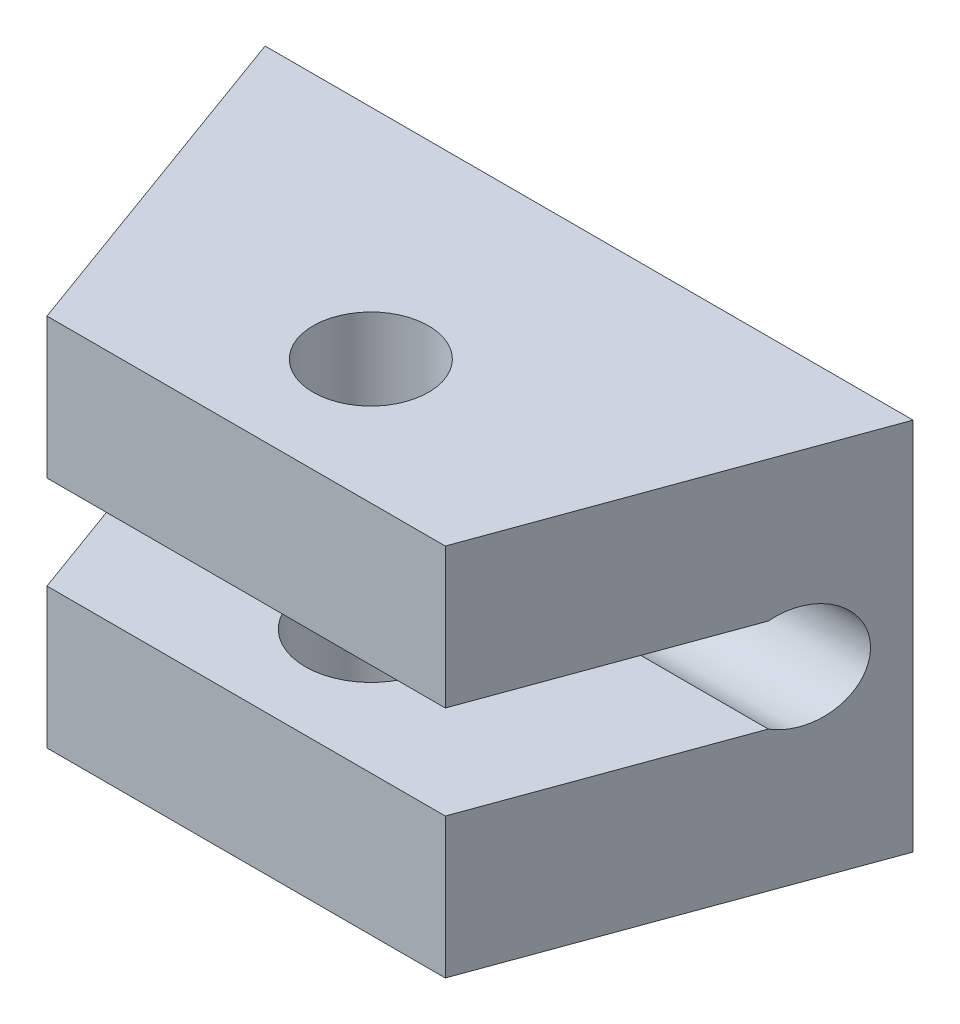
ISO-10303-21;
HEADER;
FILE_DESCRIPTION(('STEP AP214'),'2;1');
FILE_NAME('part.step','',(''),(''),'','','');
FILE_SCHEMA(('AUTOMOTIVE_DESIGN { 1 0 10303 214 1 1 1 1 }'));
ENDSEC;
DATA;
#1=APPLICATION_CONTEXT('core data for automotive mechanical design processes');
#2=APPLICATION_PROTOCOL_DEFINITION('international standard','automotive_design',2000,#1);
#3=PRODUCT_CONTEXT('',#1,'mechanical');
#4=PRODUCT('Part','Part','',(#3));
#5=PRODUCT_RELATED_PRODUCT_CATEGORY('part','',(#4));
#6=PRODUCT_DEFINITION_FORMATION('','',#4);
#7=PRODUCT_DEFINITION_CONTEXT('part definition',#1,'design');
#8=PRODUCT_DEFINITION('design','',#6,#7);
#9=PRODUCT_DEFINITION_SHAPE('','',#8);
#10=(LENGTH_UNIT() NAMED_UNIT(*) SI_UNIT(.MILLI.,.METRE.));
#11=(NAMED_UNIT(*) PLANE_ANGLE_UNIT() SI_UNIT($,.RADIAN.));
#12=(NAMED_UNIT(*) SI_UNIT($,.STERADIAN.) SOLID_ANGLE_UNIT());
#13=UNCERTAINTY_MEASURE_WITH_UNIT(LENGTH_MEASURE(1.E-05),#10,'distance_accuracy_value','');
#14=(GEOMETRIC_REPRESENTATION_CONTEXT(3) GLOBAL_UNCERTAINTY_ASSIGNED_CONTEXT((#13)) GLOBAL_UNIT_ASSIGNED_CONTEXT((#10,
#11,#12)) REPRESENTATION_CONTEXT('',''));
#15=CARTESIAN_POINT('',(0.,0.,0.));
#16=DIRECTION('',(0.,0.,1.));
#17=DIRECTION('',(1.,0.,0.));
#18=AXIS2_PLACEMENT_3D('',#15,#16,#17);
#19=CARTESIAN_POINT('',(0.,0.,5.5));
#20=DIRECTION('',(0.,0.,1.));
#21=DIRECTION('',(1.,0.,0.));
#22=AXIS2_PLACEMENT_3D('',#19,#20,#21);
#23=PLANE('',#22);
#24=DIRECTION('',(0.,-1.,0.));
#25=VECTOR('',#24,1.);
#26=CARTESIAN_POINT('',(-3.19431613424249,3.,5.5));
#27=LINE('',#26,#25);
#28=CARTESIAN_POINT('',(-3.19431613424249,-0.75,5.5));
#29=VERTEX_POINT('',#28);
#30=CARTESIAN_POINT('',(-3.19431613424249,-3.,5.5));
#31=VERTEX_POINT('',#30);
#32=EDGE_CURVE('E106',#29,#31,#27,.T.);
#33=ORIENTED_EDGE('',*,*,#32,.T.);
#34=DIRECTION('',(1.,0.,0.));
#35=VECTOR('',#34,1.);
#36=CARTESIAN_POINT('',(5.19615242270663,-3.,5.5));
#37=LINE('',#36,#35);
#38=CARTESIAN_POINT('',(3.19431613424249,-3.,5.5));
#39=VERTEX_POINT('',#38);
#40=EDGE_CURVE('E126',#31,#39,#37,.T.);
#41=ORIENTED_EDGE('',*,*,#40,.T.);
#42=DIRECTION('',(0.,-1.,0.));
#43=VECTOR('',#42,1.);
#44=CARTESIAN_POINT('',(3.19431613424249,3.,5.5));
#45=LINE('',#44,#43);
#46=CARTESIAN_POINT('',(3.19431613424249,-0.75,5.5));
#47=VERTEX_POINT('',#46);
#48=EDGE_CURVE('E173',#47,#39,#45,.T.);
#49=ORIENTED_EDGE('',*,*,#48,.F.);
#50=DIRECTION('',(1.,0.,0.));
#51=VECTOR('',#50,1.);
#52=CARTESIAN_POINT('',(-5.19615242270663,-0.75,5.5));
#53=LINE('',#52,#51);
#54=EDGE_CURVE('E139',#29,#47,#53,.T.);
#55=ORIENTED_EDGE('',*,*,#54,.F.);
#56=EDGE_LOOP('',(#33,#41,#49,#55));
#57=FACE_BOUND('',#56,.T.);
#58=ADVANCED_FACE('F32',(#57),#23,.T.);
#59=CARTESIAN_POINT('',(5.19615242270663,3.,5.5));
#60=DIRECTION('',(0.,-1.,0.));
#61=DIRECTION('',(0.,0.,-1.));
#62=AXIS2_PLACEMENT_3D('',#59,#60,#61);
#63=PLANE('',#62);
#64=CARTESIAN_POINT('',(0.,3.,3.5));
#65=DIRECTION('',(0.,1.,0.));
#66=DIRECTION('',(0.,0.,1.));
#67=AXIS2_PLACEMENT_3D('',#64,#65,#66);
#68=CIRCLE('',#67,0.925);
#69=CARTESIAN_POINT('',(0.,3.,4.425));
#70=VERTEX_POINT('',#69);
#71=EDGE_CURVE('E147',#70,#70,#68,.T.);
#72=ORIENTED_EDGE('',*,*,#71,.F.);
#73=EDGE_LOOP('',(#72));
#74=FACE_BOUND('',#73,.T.);
#75=DIRECTION('',(-1.,0.,0.));
#76=VECTOR('',#75,1.);
#77=CARTESIAN_POINT('',(5.19615242270663,3.,0.));
#78=LINE('',#77,#76);
#79=CARTESIAN_POINT('',(5.19615242270663,3.,0.));
#80=VERTEX_POINT('',#79);
#81=CARTESIAN_POINT('',(-5.19615242270663,3.,0.));
#82=VERTEX_POINT('',#81);
#83=EDGE_CURVE('E111',#80,#82,#78,.T.);
#84=ORIENTED_EDGE('',*,*,#83,.T.);
#85=DIRECTION('',(0.342020143325673,0.,0.939692620785907));
#86=VECTOR('',#85,1.);
#87=CARTESIAN_POINT('',(-5.19615242270663,3.,0.));
#88=LINE('',#87,#86);
#89=CARTESIAN_POINT('',(-3.19431613424249,3.,5.5));
#90=VERTEX_POINT('',#89);
#91=EDGE_CURVE('E96',#82,#90,#88,.T.);
#92=ORIENTED_EDGE('',*,*,#91,.T.);
#93=DIRECTION('',(-1.,0.,0.));
#94=VECTOR('',#93,1.);
#95=CARTESIAN_POINT('',(5.19615242270663,3.,5.5));
#96=LINE('',#95,#94);
#97=CARTESIAN_POINT('',(3.19431613424249,3.,5.5));
#98=VERTEX_POINT('',#97);
#99=EDGE_CURVE('E122',#98,#90,#96,.T.);
#100=ORIENTED_EDGE('',*,*,#99,.F.);
#101=DIRECTION('',(0.342020143325673,0.,-0.939692620785907));
#102=VECTOR('',#101,1.);
#103=CARTESIAN_POINT('',(5.19615242270663,3.,0.));
#104=LINE('',#103,#102);
#105=EDGE_CURVE('E112',#98,#80,#104,.T.);
#106=ORIENTED_EDGE('',*,*,#105,.T.);
#107=EDGE_LOOP('',(#84,#92,#100,#106));
#108=FACE_BOUND('',#107,.T.);
#109=ADVANCED_FACE('F34',(#74,#108),#63,.F.);
#110=CARTESIAN_POINT('',(5.19615242270663,-3.,5.5));
#111=DIRECTION('',(0.,1.,0.));
#112=DIRECTION('',(0.,0.,1.));
#113=AXIS2_PLACEMENT_3D('',#110,#111,#112);
#114=PLANE('',#113);
#115=CARTESIAN_POINT('',(0.,-3.,3.5));
#116=DIRECTION('',(0.,1.,0.));
#117=DIRECTION('',(0.,0.,1.));
#118=AXIS2_PLACEMENT_3D('',#115,#116,#117);
#119=CIRCLE('',#118,1.05);
#120=CARTESIAN_POINT('',(0.,-3.,4.55));
#121=VERTEX_POINT('',#120);
#122=EDGE_CURVE('E157',#121,#121,#119,.F.);
#123=ORIENTED_EDGE('',*,*,#122,.F.);
#124=EDGE_LOOP('',(#123));
#125=FACE_BOUND('',#124,.T.);
#126=ORIENTED_EDGE('',*,*,#40,.F.);
#127=DIRECTION('',(0.342020143325673,0.,0.939692620785907));
#128=VECTOR('',#127,1.);
#129=CARTESIAN_POINT('',(-5.19615242270663,-3.,0.));
#130=LINE('',#129,#128);
#131=CARTESIAN_POINT('',(-5.19615242270663,-3.,0.));
#132=VERTEX_POINT('',#131);
#133=EDGE_CURVE('E107',#132,#31,#130,.T.);
#134=ORIENTED_EDGE('',*,*,#133,.F.);
#135=DIRECTION('',(1.,0.,0.));
#136=VECTOR('',#135,1.);
#137=CARTESIAN_POINT('',(5.19615242270663,-3.,0.));
#138=LINE('',#137,#136);
#139=CARTESIAN_POINT('',(5.19615242270663,-3.,0.));
#140=VERTEX_POINT('',#139);
#141=EDGE_CURVE('E120',#132,#140,#138,.T.);
#142=ORIENTED_EDGE('',*,*,#141,.T.);
#143=DIRECTION('',(0.342020143325673,0.,-0.939692620785907));
#144=VECTOR('',#143,1.);
#145=CARTESIAN_POINT('',(5.19615242270663,-3.,0.));
#146=LINE('',#145,#144);
#147=EDGE_CURVE('E174',#39,#140,#146,.T.);
#148=ORIENTED_EDGE('',*,*,#147,.F.);
#149=EDGE_LOOP('',(#126,#134,#142,#148));
#150=FACE_BOUND('',#149,.T.);
#151=ADVANCED_FACE('F185',(#125,#150),#114,.F.);
#152=CARTESIAN_POINT('',(-3.19431613424249,0.75,5.5));
#153=VERTEX_POINT('',#152);
#154=EDGE_CURVE('E102',#90,#153,#27,.T.);
#155=ORIENTED_EDGE('',*,*,#154,.T.);
#156=DIRECTION('',(1.,0.,0.));
#157=VECTOR('',#156,1.);
#158=CARTESIAN_POINT('',(-5.19615242270663,0.75,5.5));
#159=LINE('',#158,#157);
#160=CARTESIAN_POINT('',(3.19431613424249,0.75,5.5));
#161=VERTEX_POINT('',#160);
#162=EDGE_CURVE('E54',#153,#161,#159,.T.);
#163=ORIENTED_EDGE('',*,*,#162,.T.);
#164=EDGE_CURVE('E171',#98,#161,#45,.T.);
#165=ORIENTED_EDGE('',*,*,#164,.F.);
#166=ORIENTED_EDGE('',*,*,#99,.T.);
#167=EDGE_LOOP('',(#155,#163,#165,#166));
#168=FACE_BOUND('',#167,.T.);
#169=ADVANCED_FACE('F200',(#168),#23,.T.);
#170=CARTESIAN_POINT('',(0.,0.,0.));
#171=DIRECTION('',(0.,0.,1.));
#172=DIRECTION('',(1.,0.,0.));
#173=AXIS2_PLACEMENT_3D('',#170,#171,#172);
#174=PLANE('',#173);
#175=DIRECTION('',(0.,1.,0.));
#176=VECTOR('',#175,1.);
#177=CARTESIAN_POINT('',(5.19615242270663,-3.,0.));
#178=LINE('',#177,#176);
#179=EDGE_CURVE('E115',#140,#80,#178,.T.);
#180=ORIENTED_EDGE('',*,*,#179,.F.);
#181=ORIENTED_EDGE('',*,*,#141,.F.);
#182=DIRECTION('',(0.,-1.,0.));
#183=VECTOR('',#182,1.);
#184=CARTESIAN_POINT('',(-5.19615242270663,-3.,0.));
#185=LINE('',#184,#183);
#186=EDGE_CURVE('E100',#82,#132,#185,.T.);
#187=ORIENTED_EDGE('',*,*,#186,.F.);
#188=ORIENTED_EDGE('',*,*,#83,.F.);
#189=EDGE_LOOP('',(#180,#181,#187,#188));
#190=FACE_BOUND('',#189,.T.);
#191=ADVANCED_FACE('F118',(#190),#174,.F.);
#192=CARTESIAN_POINT('',(-5.19615242270663,0.,1.335));
#193=DIRECTION('',(1.,0.,0.));
#194=DIRECTION('',(0.,0.,-1.));
#195=AXIS2_PLACEMENT_3D('',#192,#193,#194);
#196=CYLINDRICAL_SURFACE('',#195,0.835);
#197=DIRECTION('',(1.,0.,0.));
#198=VECTOR('',#197,1.);
#199=CARTESIAN_POINT('',(-5.19615242270663,0.75,1.70204904304466));
#200=LINE('',#199,#198);
#201=CARTESIAN_POINT('',(-4.57665723377709,0.75,1.70204904304466));
#202=VERTEX_POINT('',#201);
#203=CARTESIAN_POINT('',(4.57665723377709,0.75,1.70204904304466));
#204=VERTEX_POINT('',#203);
#205=EDGE_CURVE('E150',#202,#204,#200,.T.);
#206=ORIENTED_EDGE('',*,*,#205,.F.);
#207=CARTESIAN_POINT('',(-4.71025215996125,0.,1.335));
#208=DIRECTION('',(0.939692620785907,0.,-0.342020143325673));
#209=DIRECTION('',(0.342020143325673,0.,0.939692620785907));
#210=AXIS2_PLACEMENT_3D('',#207,#208,#209);
#211=ELLIPSE('',#210,0.888588440017388,0.835);
#212=CARTESIAN_POINT('',(-4.57665723377709,-0.75,1.70204904304466));
#213=VERTEX_POINT('',#212);
#214=EDGE_CURVE('E47',#202,#213,#211,.F.);
#215=ORIENTED_EDGE('',*,*,#214,.T.);
#216=DIRECTION('',(1.,0.,0.));
#217=VECTOR('',#216,1.);
#218=CARTESIAN_POINT('',(-5.19615242270663,-0.75,1.70204904304466));
#219=LINE('',#218,#217);
#220=CARTESIAN_POINT('',(4.57665723377709,-0.75,1.70204904304466));
#221=VERTEX_POINT('',#220);
#222=EDGE_CURVE('E137',#213,#221,#219,.T.);
#223=ORIENTED_EDGE('',*,*,#222,.T.);
#224=CARTESIAN_POINT('',(4.71025215996125,0.,1.335));
#225=DIRECTION('',(-0.939692620785907,0.,-0.342020143325673));
#226=DIRECTION('',(0.342020143325673,0.,-0.939692620785907));
#227=AXIS2_PLACEMENT_3D('',#224,#225,#226);
#228=ELLIPSE('',#227,0.888588440017388,0.835);
#229=EDGE_CURVE('E169',#221,#204,#228,.F.);
#230=ORIENTED_EDGE('',*,*,#229,.T.);
#231=EDGE_LOOP('',(#206,#215,#223,#230));
#232=FACE_BOUND('',#231,.T.);
#233=ADVANCED_FACE('F190',(#232),#196,.F.);
#234=CARTESIAN_POINT('',(-5.19615242270663,-0.75,1.70204904304466));
#235=DIRECTION('',(0.,-1.,0.));
#236=DIRECTION('',(0.,0.,-1.));
#237=AXIS2_PLACEMENT_3D('',#234,#235,#236);
#238=PLANE('',#237);
#239=CARTESIAN_POINT('',(0.,-0.75,3.5));
#240=DIRECTION('',(0.,1.,0.));
#241=DIRECTION('',(0.,0.,1.));
#242=AXIS2_PLACEMENT_3D('',#239,#240,#241);
#243=CIRCLE('',#242,1.05);
#244=CARTESIAN_POINT('',(0.,-0.75,4.55));
#245=VERTEX_POINT('',#244);
#246=EDGE_CURVE('E161',#245,#245,#243,.T.);
#247=ORIENTED_EDGE('',*,*,#246,.F.);
#248=EDGE_LOOP('',(#247));
#249=FACE_BOUND('',#248,.T.);
#250=ORIENTED_EDGE('',*,*,#222,.F.);
#251=DIRECTION('',(0.342020143325673,0.,0.939692620785907));
#252=VECTOR('',#251,1.);
#253=CARTESIAN_POINT('',(-4.64912440473266,-0.75,1.50294712719249));
#254=LINE('',#253,#252);
#255=EDGE_CURVE('E176',#213,#29,#254,.T.);
#256=ORIENTED_EDGE('',*,*,#255,.T.);
#257=ORIENTED_EDGE('',*,*,#54,.T.);
#258=DIRECTION('',(0.342020143325673,0.,-0.939692620785907));
#259=VECTOR('',#258,1.);
#260=CARTESIAN_POINT('',(3.43345567103963,-0.75,4.84296952255104));
#261=LINE('',#260,#259);
#262=EDGE_CURVE('E166',#47,#221,#261,.T.);
#263=ORIENTED_EDGE('',*,*,#262,.T.);
#264=EDGE_LOOP('',(#250,#256,#257,#263));
#265=FACE_BOUND('',#264,.T.);
#266=ADVANCED_FACE('F189',(#249,#265),#238,.F.);
#267=CARTESIAN_POINT('',(-5.19615242270663,0.75,1.70204904304466));
#268=DIRECTION('',(0.,1.,0.));
#269=DIRECTION('',(0.,0.,1.));
#270=AXIS2_PLACEMENT_3D('',#267,#268,#269);
#271=PLANE('',#270);
#272=CARTESIAN_POINT('',(0.,0.75,3.5));
#273=DIRECTION('',(0.,1.,0.));
#274=DIRECTION('',(0.,0.,1.));
#275=AXIS2_PLACEMENT_3D('',#272,#273,#274);
#276=CIRCLE('',#275,0.925);
#277=CARTESIAN_POINT('',(0.,0.75,4.425));
#278=VERTEX_POINT('',#277);
#279=EDGE_CURVE('E153',#278,#278,#276,.F.);
#280=ORIENTED_EDGE('',*,*,#279,.F.);
#281=EDGE_LOOP('',(#280));
#282=FACE_BOUND('',#281,.T.);
#283=ORIENTED_EDGE('',*,*,#162,.F.);
#284=DIRECTION('',(-0.342020143325673,0.,-0.939692620785907));
#285=VECTOR('',#284,1.);
#286=CARTESIAN_POINT('',(-4.64912440473266,0.75,1.50294712719249));
#287=LINE('',#286,#285);
#288=EDGE_CURVE('E11',#153,#202,#287,.T.);
#289=ORIENTED_EDGE('',*,*,#288,.T.);
#290=ORIENTED_EDGE('',*,*,#205,.T.);
#291=DIRECTION('',(-0.342020143325673,0.,0.939692620785907));
#292=VECTOR('',#291,1.);
#293=CARTESIAN_POINT('',(3.43345567103963,0.75,4.84296952255104));
#294=LINE('',#293,#292);
#295=EDGE_CURVE('E40',#204,#161,#294,.T.);
#296=ORIENTED_EDGE('',*,*,#295,.T.);
#297=EDGE_LOOP('',(#283,#289,#290,#296));
#298=FACE_BOUND('',#297,.T.);
#299=ADVANCED_FACE('F197',(#282,#298),#271,.F.);
#300=CARTESIAN_POINT('',(0.,-3.001,3.5));
#301=DIRECTION('',(0.,1.,0.));
#302=DIRECTION('',(0.,0.,1.));
#303=AXIS2_PLACEMENT_3D('',#300,#301,#302);
#304=CYLINDRICAL_SURFACE('',#303,0.925);
#305=ORIENTED_EDGE('',*,*,#71,.T.);
#306=EDGE_LOOP('',(#305));
#307=FACE_BOUND('',#306,.T.);
#308=ORIENTED_EDGE('',*,*,#279,.T.);
#309=EDGE_LOOP('',(#308));
#310=FACE_BOUND('',#309,.T.);
#311=ADVANCED_FACE('F215',(#307,#310),#304,.F.);
#312=CARTESIAN_POINT('',(0.,-3.001,3.5));
#313=DIRECTION('',(0.,1.,0.));
#314=DIRECTION('',(0.,0.,1.));
#315=AXIS2_PLACEMENT_3D('',#312,#313,#314);
#316=CYLINDRICAL_SURFACE('',#315,1.05);
#317=ORIENTED_EDGE('',*,*,#246,.T.);
#318=EDGE_LOOP('',(#317));
#319=FACE_BOUND('',#318,.T.);
#320=ORIENTED_EDGE('',*,*,#122,.T.);
#321=EDGE_LOOP('',(#320));
#322=FACE_BOUND('',#321,.T.);
#323=ADVANCED_FACE('F220',(#319,#322),#316,.F.);
#324=CARTESIAN_POINT('',(5.19615242270663,3.,0.));
#325=DIRECTION('',(-0.939692620785907,0.,-0.342020143325673));
#326=DIRECTION('',(-0.342020143325673,0.,0.939692620785907));
#327=AXIS2_PLACEMENT_3D('',#324,#325,#326);
#328=PLANE('',#327);
#329=ORIENTED_EDGE('',*,*,#48,.T.);
#330=ORIENTED_EDGE('',*,*,#147,.T.);
#331=ORIENTED_EDGE('',*,*,#179,.T.);
#332=ORIENTED_EDGE('',*,*,#105,.F.);
#333=ORIENTED_EDGE('',*,*,#164,.T.);
#334=ORIENTED_EDGE('',*,*,#295,.F.);
#335=ORIENTED_EDGE('',*,*,#229,.F.);
#336=ORIENTED_EDGE('',*,*,#262,.F.);
#337=EDGE_LOOP('',(#329,#330,#331,#332,#333,#334,#335,#336));
#338=FACE_BOUND('',#337,.T.);
#339=ADVANCED_FACE('F186',(#338),#328,.F.);
#340=CARTESIAN_POINT('',(-5.19615242270663,3.,0.));
#341=DIRECTION('',(0.939692620785907,0.,-0.342020143325673));
#342=DIRECTION('',(-0.342020143325673,0.,-0.939692620785907));
#343=AXIS2_PLACEMENT_3D('',#340,#341,#342);
#344=PLANE('',#343);
#345=ORIENTED_EDGE('',*,*,#214,.F.);
#346=ORIENTED_EDGE('',*,*,#288,.F.);
#347=ORIENTED_EDGE('',*,*,#154,.F.);
#348=ORIENTED_EDGE('',*,*,#91,.F.);
#349=ORIENTED_EDGE('',*,*,#186,.T.);
#350=ORIENTED_EDGE('',*,*,#133,.T.);
#351=ORIENTED_EDGE('',*,*,#32,.F.);
#352=ORIENTED_EDGE('',*,*,#255,.F.);
#353=EDGE_LOOP('',(#345,#346,#347,#348,#349,#350,#351,#352));
#354=FACE_BOUND('',#353,.T.);
#355=ADVANCED_FACE('F98',(#354),#344,.F.);
#356=CLOSED_SHELL('',(#58,#109,#151,#169,#191,#233,#266,#299,#311,#323,#339,#355));
#357=MANIFOLD_SOLID_BREP('B2',#356);
#358=ADVANCED_BREP_SHAPE_REPRESENTATION('',(#18,#357),#14);
#359=SHAPE_DEFINITION_REPRESENTATION(#9,#358);
ENDSEC;
END-ISO-10303-21;
